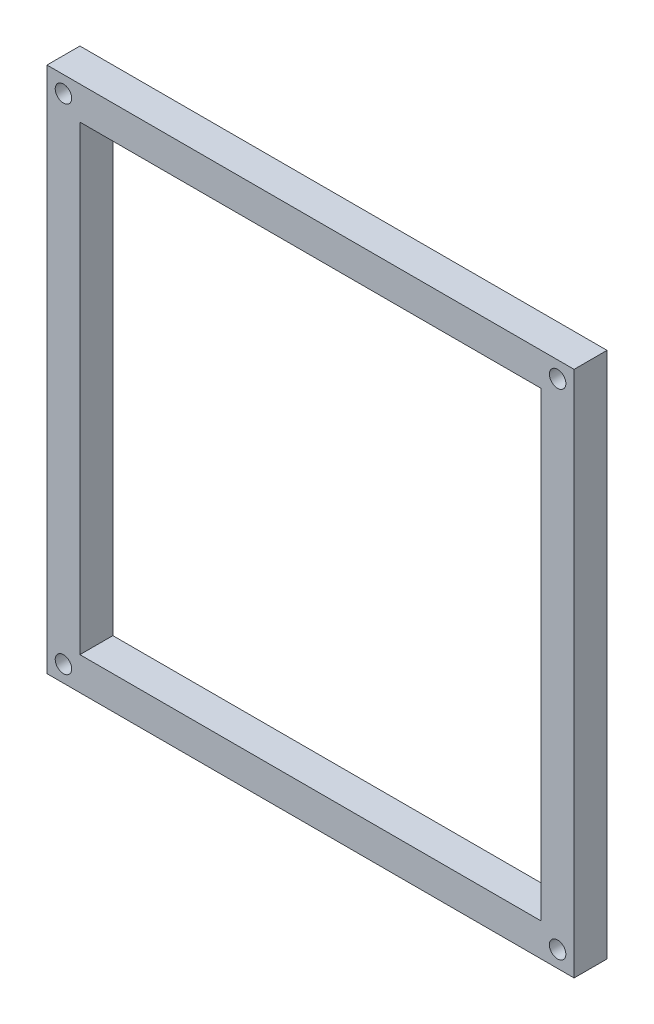
ISO-10303-21;
HEADER;
FILE_DESCRIPTION(('STEP AP214'),'2;1');
FILE_NAME('part.step','',(''),(''),'','','');
FILE_SCHEMA(('AUTOMOTIVE_DESIGN { 1 0 10303 214 1 1 1 1 }'));
ENDSEC;
DATA;
#1=APPLICATION_CONTEXT('core data for automotive mechanical design processes');
#2=APPLICATION_PROTOCOL_DEFINITION('international standard','automotive_design',2000,#1);
#3=PRODUCT_CONTEXT('',#1,'mechanical');
#4=PRODUCT('Part','Part','',(#3));
#5=PRODUCT_RELATED_PRODUCT_CATEGORY('part','',(#4));
#6=PRODUCT_DEFINITION_FORMATION('','',#4);
#7=PRODUCT_DEFINITION_CONTEXT('part definition',#1,'design');
#8=PRODUCT_DEFINITION('design','',#6,#7);
#9=PRODUCT_DEFINITION_SHAPE('','',#8);
#10=(LENGTH_UNIT() NAMED_UNIT(*) SI_UNIT(.MILLI.,.METRE.));
#11=(NAMED_UNIT(*) PLANE_ANGLE_UNIT() SI_UNIT($,.RADIAN.));
#12=(NAMED_UNIT(*) SI_UNIT($,.STERADIAN.) SOLID_ANGLE_UNIT());
#13=UNCERTAINTY_MEASURE_WITH_UNIT(LENGTH_MEASURE(1.E-05),#10,'distance_accuracy_value','');
#14=(GEOMETRIC_REPRESENTATION_CONTEXT(3) GLOBAL_UNCERTAINTY_ASSIGNED_CONTEXT((#13)) GLOBAL_UNIT_ASSIGNED_CONTEXT((#10,
#11,#12)) REPRESENTATION_CONTEXT('',''));
#15=CARTESIAN_POINT('',(0.,0.,0.));
#16=DIRECTION('',(0.,0.,1.));
#17=DIRECTION('',(1.,0.,0.));
#18=AXIS2_PLACEMENT_3D('',#15,#16,#17);
#19=CARTESIAN_POINT('',(0.,0.,10.));
#20=DIRECTION('',(0.,0.,1.));
#21=DIRECTION('',(1.,0.,0.));
#22=AXIS2_PLACEMENT_3D('',#19,#20,#21);
#23=PLANE('',#22);
#24=CARTESIAN_POINT('',(5.,-155.,10.));
#25=DIRECTION('',(0.,0.,1.));
#26=DIRECTION('',(1.,0.,0.));
#27=AXIS2_PLACEMENT_3D('',#24,#25,#26);
#28=CIRCLE('',#27,2.5);
#29=CARTESIAN_POINT('',(7.5,-155.,10.));
#30=VERTEX_POINT('',#29);
#31=EDGE_CURVE('E182',#30,#30,#28,.T.);
#32=ORIENTED_EDGE('',*,*,#31,.F.);
#33=EDGE_LOOP('',(#32));
#34=FACE_BOUND('',#33,.T.);
#35=CARTESIAN_POINT('',(5.00000000000001,-4.99999999999999,10.));
#36=DIRECTION('',(0.,0.,1.));
#37=DIRECTION('',(1.,0.,0.));
#38=AXIS2_PLACEMENT_3D('',#35,#36,#37);
#39=CIRCLE('',#38,2.49999999999996);
#40=CARTESIAN_POINT('',(7.49999999999996,-4.99999999999999,10.));
#41=VERTEX_POINT('',#40);
#42=EDGE_CURVE('E188',#41,#41,#39,.T.);
#43=ORIENTED_EDGE('',*,*,#42,.F.);
#44=EDGE_LOOP('',(#43));
#45=FACE_BOUND('',#44,.T.);
#46=CARTESIAN_POINT('',(155.,-4.99999999999997,10.));
#47=DIRECTION('',(0.,0.,1.));
#48=DIRECTION('',(1.,0.,0.));
#49=AXIS2_PLACEMENT_3D('',#46,#47,#48);
#50=CIRCLE('',#49,2.50000000000007);
#51=CARTESIAN_POINT('',(157.5,-4.99999999999997,10.));
#52=VERTEX_POINT('',#51);
#53=EDGE_CURVE('E176',#52,#52,#50,.T.);
#54=ORIENTED_EDGE('',*,*,#53,.F.);
#55=EDGE_LOOP('',(#54));
#56=FACE_BOUND('',#55,.T.);
#57=CARTESIAN_POINT('',(155.,-155.,10.));
#58=DIRECTION('',(0.,0.,1.));
#59=DIRECTION('',(1.,0.,0.));
#60=AXIS2_PLACEMENT_3D('',#57,#58,#59);
#61=CIRCLE('',#60,2.5);
#62=CARTESIAN_POINT('',(157.5,-155.,10.));
#63=VERTEX_POINT('',#62);
#64=EDGE_CURVE('E173',#63,#63,#61,.T.);
#65=ORIENTED_EDGE('',*,*,#64,.F.);
#66=EDGE_LOOP('',(#65));
#67=FACE_BOUND('',#66,.T.);
#68=DIRECTION('',(-1.,0.,0.));
#69=VECTOR('',#68,1.);
#70=CARTESIAN_POINT('',(0.,0.,10.));
#71=LINE('',#70,#69);
#72=CARTESIAN_POINT('',(160.,0.,10.));
#73=VERTEX_POINT('',#72);
#74=CARTESIAN_POINT('',(0.,0.,10.));
#75=VERTEX_POINT('',#74);
#76=EDGE_CURVE('E105',#73,#75,#71,.T.);
#77=ORIENTED_EDGE('',*,*,#76,.T.);
#78=DIRECTION('',(0.,-1.,0.));
#79=VECTOR('',#78,1.);
#80=CARTESIAN_POINT('',(0.,0.,10.));
#81=LINE('',#80,#79);
#82=CARTESIAN_POINT('',(0.,-160.,10.));
#83=VERTEX_POINT('',#82);
#84=EDGE_CURVE('E107',#75,#83,#81,.T.);
#85=ORIENTED_EDGE('',*,*,#84,.T.);
#86=DIRECTION('',(1.,0.,0.));
#87=VECTOR('',#86,1.);
#88=CARTESIAN_POINT('',(0.,-160.,10.));
#89=LINE('',#88,#87);
#90=CARTESIAN_POINT('',(160.,-160.,10.));
#91=VERTEX_POINT('',#90);
#92=EDGE_CURVE('E114',#83,#91,#89,.T.);
#93=ORIENTED_EDGE('',*,*,#92,.T.);
#94=DIRECTION('',(0.,1.,0.));
#95=VECTOR('',#94,1.);
#96=CARTESIAN_POINT('',(160.,0.,10.));
#97=LINE('',#96,#95);
#98=EDGE_CURVE('E110',#91,#73,#97,.T.);
#99=ORIENTED_EDGE('',*,*,#98,.T.);
#100=EDGE_LOOP('',(#77,#85,#93,#99));
#101=FACE_BOUND('',#100,.T.);
#102=DIRECTION('',(-1.,0.,0.));
#103=VECTOR('',#102,1.);
#104=CARTESIAN_POINT('',(10.,-10.,10.));
#105=LINE('',#104,#103);
#106=CARTESIAN_POINT('',(150.,-10.,10.));
#107=VERTEX_POINT('',#106);
#108=CARTESIAN_POINT('',(10.,-10.,10.));
#109=VERTEX_POINT('',#108);
#110=EDGE_CURVE('E156',#107,#109,#105,.T.);
#111=ORIENTED_EDGE('',*,*,#110,.F.);
#112=DIRECTION('',(0.,1.,0.));
#113=VECTOR('',#112,1.);
#114=CARTESIAN_POINT('',(150.,-10.,10.));
#115=LINE('',#114,#113);
#116=CARTESIAN_POINT('',(150.,-150.,10.));
#117=VERTEX_POINT('',#116);
#118=EDGE_CURVE('E152',#117,#107,#115,.T.);
#119=ORIENTED_EDGE('',*,*,#118,.F.);
#120=DIRECTION('',(1.,0.,0.));
#121=VECTOR('',#120,1.);
#122=CARTESIAN_POINT('',(10.,-150.,10.));
#123=LINE('',#122,#121);
#124=CARTESIAN_POINT('',(10.,-150.,10.));
#125=VERTEX_POINT('',#124);
#126=EDGE_CURVE('E166',#125,#117,#123,.T.);
#127=ORIENTED_EDGE('',*,*,#126,.F.);
#128=DIRECTION('',(0.,-1.,0.));
#129=VECTOR('',#128,1.);
#130=CARTESIAN_POINT('',(10.,-10.,10.));
#131=LINE('',#130,#129);
#132=EDGE_CURVE('E169',#109,#125,#131,.T.);
#133=ORIENTED_EDGE('',*,*,#132,.F.);
#134=EDGE_LOOP('',(#111,#119,#127,#133));
#135=FACE_BOUND('',#134,.T.);
#136=ADVANCED_FACE('F37',(#34,#45,#56,#67,#101,#135),#23,.T.);
#137=CARTESIAN_POINT('',(0.,0.,0.));
#138=DIRECTION('',(0.,0.,1.));
#139=DIRECTION('',(1.,0.,0.));
#140=AXIS2_PLACEMENT_3D('',#137,#138,#139);
#141=PLANE('',#140);
#142=DIRECTION('',(0.,-1.,0.));
#143=VECTOR('',#142,1.);
#144=CARTESIAN_POINT('',(10.,-10.,0.));
#145=LINE('',#144,#143);
#146=CARTESIAN_POINT('',(10.,-10.,0.));
#147=VERTEX_POINT('',#146);
#148=CARTESIAN_POINT('',(10.,-150.,0.));
#149=VERTEX_POINT('',#148);
#150=EDGE_CURVE('E160',#147,#149,#145,.T.);
#151=ORIENTED_EDGE('',*,*,#150,.T.);
#152=DIRECTION('',(1.,0.,0.));
#153=VECTOR('',#152,1.);
#154=CARTESIAN_POINT('',(10.,-150.,0.));
#155=LINE('',#154,#153);
#156=CARTESIAN_POINT('',(150.,-150.,0.));
#157=VERTEX_POINT('',#156);
#158=EDGE_CURVE('E157',#149,#157,#155,.T.);
#159=ORIENTED_EDGE('',*,*,#158,.T.);
#160=DIRECTION('',(0.,1.,0.));
#161=VECTOR('',#160,1.);
#162=CARTESIAN_POINT('',(150.,-10.,0.));
#163=LINE('',#162,#161);
#164=CARTESIAN_POINT('',(150.,-10.,0.));
#165=VERTEX_POINT('',#164);
#166=EDGE_CURVE('E153',#157,#165,#163,.T.);
#167=ORIENTED_EDGE('',*,*,#166,.T.);
#168=DIRECTION('',(-1.,0.,0.));
#169=VECTOR('',#168,1.);
#170=CARTESIAN_POINT('',(10.,-10.,0.));
#171=LINE('',#170,#169);
#172=EDGE_CURVE('E52',#165,#147,#171,.T.);
#173=ORIENTED_EDGE('',*,*,#172,.T.);
#174=EDGE_LOOP('',(#151,#159,#167,#173));
#175=FACE_BOUND('',#174,.T.);
#176=DIRECTION('',(0.,1.,0.));
#177=VECTOR('',#176,1.);
#178=CARTESIAN_POINT('',(160.,0.,0.));
#179=LINE('',#178,#177);
#180=CARTESIAN_POINT('',(160.,-160.,0.));
#181=VERTEX_POINT('',#180);
#182=CARTESIAN_POINT('',(160.,0.,0.));
#183=VERTEX_POINT('',#182);
#184=EDGE_CURVE('E131',#181,#183,#179,.T.);
#185=ORIENTED_EDGE('',*,*,#184,.F.);
#186=DIRECTION('',(1.,0.,0.));
#187=VECTOR('',#186,1.);
#188=CARTESIAN_POINT('',(0.,-160.,0.));
#189=LINE('',#188,#187);
#190=CARTESIAN_POINT('',(0.,-160.,0.));
#191=VERTEX_POINT('',#190);
#192=EDGE_CURVE('E134',#191,#181,#189,.T.);
#193=ORIENTED_EDGE('',*,*,#192,.F.);
#194=DIRECTION('',(0.,-1.,0.));
#195=VECTOR('',#194,1.);
#196=CARTESIAN_POINT('',(0.,0.,0.));
#197=LINE('',#196,#195);
#198=CARTESIAN_POINT('',(0.,0.,0.));
#199=VERTEX_POINT('',#198);
#200=EDGE_CURVE('E137',#199,#191,#197,.T.);
#201=ORIENTED_EDGE('',*,*,#200,.F.);
#202=DIRECTION('',(-1.,0.,0.));
#203=VECTOR('',#202,1.);
#204=CARTESIAN_POINT('',(0.,0.,0.));
#205=LINE('',#204,#203);
#206=EDGE_CURVE('E115',#183,#199,#205,.T.);
#207=ORIENTED_EDGE('',*,*,#206,.F.);
#208=EDGE_LOOP('',(#185,#193,#201,#207));
#209=FACE_BOUND('',#208,.T.);
#210=ADVANCED_FACE('F139',(#175,#209),#141,.F.);
#211=CARTESIAN_POINT('',(0.,0.,10.));
#212=DIRECTION('',(1.,0.,0.));
#213=DIRECTION('',(0.,1.,0.));
#214=AXIS2_PLACEMENT_3D('',#211,#212,#213);
#215=PLANE('',#214);
#216=DIRECTION('',(0.,0.,-1.));
#217=VECTOR('',#216,1.);
#218=CARTESIAN_POINT('',(0.,-160.,10.));
#219=LINE('',#218,#217);
#220=EDGE_CURVE('E11',#83,#191,#219,.T.);
#221=ORIENTED_EDGE('',*,*,#220,.F.);
#222=ORIENTED_EDGE('',*,*,#84,.F.);
#223=DIRECTION('',(0.,0.,-1.));
#224=VECTOR('',#223,1.);
#225=CARTESIAN_POINT('',(0.,0.,10.));
#226=LINE('',#225,#224);
#227=EDGE_CURVE('E60',#75,#199,#226,.T.);
#228=ORIENTED_EDGE('',*,*,#227,.T.);
#229=ORIENTED_EDGE('',*,*,#200,.T.);
#230=EDGE_LOOP('',(#221,#222,#228,#229));
#231=FACE_BOUND('',#230,.T.);
#232=ADVANCED_FACE('F39',(#231),#215,.F.);
#233=CARTESIAN_POINT('',(0.,-160.,10.));
#234=DIRECTION('',(0.,1.,0.));
#235=DIRECTION('',(0.,0.,1.));
#236=AXIS2_PLACEMENT_3D('',#233,#234,#235);
#237=PLANE('',#236);
#238=DIRECTION('',(0.,0.,-1.));
#239=VECTOR('',#238,1.);
#240=CARTESIAN_POINT('',(160.,-160.,10.));
#241=LINE('',#240,#239);
#242=EDGE_CURVE('E45',#91,#181,#241,.T.);
#243=ORIENTED_EDGE('',*,*,#242,.F.);
#244=ORIENTED_EDGE('',*,*,#92,.F.);
#245=ORIENTED_EDGE('',*,*,#220,.T.);
#246=ORIENTED_EDGE('',*,*,#192,.T.);
#247=EDGE_LOOP('',(#243,#244,#245,#246));
#248=FACE_BOUND('',#247,.T.);
#249=ADVANCED_FACE('F135',(#248),#237,.F.);
#250=CARTESIAN_POINT('',(160.,0.,10.));
#251=DIRECTION('',(-1.,0.,0.));
#252=DIRECTION('',(0.,-1.,0.));
#253=AXIS2_PLACEMENT_3D('',#250,#251,#252);
#254=PLANE('',#253);
#255=DIRECTION('',(0.,0.,-1.));
#256=VECTOR('',#255,1.);
#257=CARTESIAN_POINT('',(160.,0.,10.));
#258=LINE('',#257,#256);
#259=EDGE_CURVE('E120',#73,#183,#258,.T.);
#260=ORIENTED_EDGE('',*,*,#259,.F.);
#261=ORIENTED_EDGE('',*,*,#98,.F.);
#262=ORIENTED_EDGE('',*,*,#242,.T.);
#263=ORIENTED_EDGE('',*,*,#184,.T.);
#264=EDGE_LOOP('',(#260,#261,#262,#263));
#265=FACE_BOUND('',#264,.T.);
#266=ADVANCED_FACE('F129',(#265),#254,.F.);
#267=CARTESIAN_POINT('',(0.,0.,10.));
#268=DIRECTION('',(0.,-1.,0.));
#269=DIRECTION('',(0.,0.,-1.));
#270=AXIS2_PLACEMENT_3D('',#267,#268,#269);
#271=PLANE('',#270);
#272=ORIENTED_EDGE('',*,*,#227,.F.);
#273=ORIENTED_EDGE('',*,*,#76,.F.);
#274=ORIENTED_EDGE('',*,*,#259,.T.);
#275=ORIENTED_EDGE('',*,*,#206,.T.);
#276=EDGE_LOOP('',(#272,#273,#274,#275));
#277=FACE_BOUND('',#276,.T.);
#278=ADVANCED_FACE('F117',(#277),#271,.F.);
#279=CARTESIAN_POINT('',(10.,-10.,10.));
#280=DIRECTION('',(0.,-1.,0.));
#281=DIRECTION('',(0.,0.,-1.));
#282=AXIS2_PLACEMENT_3D('',#279,#280,#281);
#283=PLANE('',#282);
#284=ORIENTED_EDGE('',*,*,#172,.F.);
#285=DIRECTION('',(0.,0.,-1.));
#286=VECTOR('',#285,1.);
#287=CARTESIAN_POINT('',(150.,-10.,10.));
#288=LINE('',#287,#286);
#289=EDGE_CURVE('E150',#107,#165,#288,.T.);
#290=ORIENTED_EDGE('',*,*,#289,.F.);
#291=ORIENTED_EDGE('',*,*,#110,.T.);
#292=DIRECTION('',(0.,0.,-1.));
#293=VECTOR('',#292,1.);
#294=CARTESIAN_POINT('',(10.,-10.,10.));
#295=LINE('',#294,#293);
#296=EDGE_CURVE('E141',#109,#147,#295,.T.);
#297=ORIENTED_EDGE('',*,*,#296,.T.);
#298=EDGE_LOOP('',(#284,#290,#291,#297));
#299=FACE_BOUND('',#298,.T.);
#300=ADVANCED_FACE('F229',(#299),#283,.T.);
#301=CARTESIAN_POINT('',(10.,-10.,10.));
#302=DIRECTION('',(1.,0.,0.));
#303=DIRECTION('',(0.,1.,0.));
#304=AXIS2_PLACEMENT_3D('',#301,#302,#303);
#305=PLANE('',#304);
#306=ORIENTED_EDGE('',*,*,#150,.F.);
#307=ORIENTED_EDGE('',*,*,#296,.F.);
#308=ORIENTED_EDGE('',*,*,#132,.T.);
#309=DIRECTION('',(0.,0.,-1.));
#310=VECTOR('',#309,1.);
#311=CARTESIAN_POINT('',(10.,-150.,10.));
#312=LINE('',#311,#310);
#313=EDGE_CURVE('E146',#125,#149,#312,.T.);
#314=ORIENTED_EDGE('',*,*,#313,.T.);
#315=EDGE_LOOP('',(#306,#307,#308,#314));
#316=FACE_BOUND('',#315,.T.);
#317=ADVANCED_FACE('F225',(#316),#305,.T.);
#318=CARTESIAN_POINT('',(10.,-150.,10.));
#319=DIRECTION('',(0.,1.,0.));
#320=DIRECTION('',(0.,0.,1.));
#321=AXIS2_PLACEMENT_3D('',#318,#319,#320);
#322=PLANE('',#321);
#323=ORIENTED_EDGE('',*,*,#158,.F.);
#324=ORIENTED_EDGE('',*,*,#313,.F.);
#325=ORIENTED_EDGE('',*,*,#126,.T.);
#326=DIRECTION('',(0.,0.,-1.));
#327=VECTOR('',#326,1.);
#328=CARTESIAN_POINT('',(150.,-150.,10.));
#329=LINE('',#328,#327);
#330=EDGE_CURVE('E148',#117,#157,#329,.T.);
#331=ORIENTED_EDGE('',*,*,#330,.T.);
#332=EDGE_LOOP('',(#323,#324,#325,#331));
#333=FACE_BOUND('',#332,.T.);
#334=ADVANCED_FACE('F217',(#333),#322,.T.);
#335=CARTESIAN_POINT('',(150.,-10.,10.));
#336=DIRECTION('',(-1.,0.,0.));
#337=DIRECTION('',(0.,-1.,0.));
#338=AXIS2_PLACEMENT_3D('',#335,#336,#337);
#339=PLANE('',#338);
#340=ORIENTED_EDGE('',*,*,#166,.F.);
#341=ORIENTED_EDGE('',*,*,#330,.F.);
#342=ORIENTED_EDGE('',*,*,#118,.T.);
#343=ORIENTED_EDGE('',*,*,#289,.T.);
#344=EDGE_LOOP('',(#340,#341,#342,#343));
#345=FACE_BOUND('',#344,.T.);
#346=ADVANCED_FACE('F208',(#345),#339,.T.);
#347=CARTESIAN_POINT('',(155.,-155.,6.));
#348=DIRECTION('',(0.,0.,1.));
#349=DIRECTION('',(1.,0.,0.));
#350=AXIS2_PLACEMENT_3D('',#347,#348,#349);
#351=CYLINDRICAL_SURFACE('',#350,2.5);
#352=CARTESIAN_POINT('',(155.,-155.,6.));
#353=DIRECTION('',(0.,0.,1.));
#354=DIRECTION('',(1.,0.,0.));
#355=AXIS2_PLACEMENT_3D('',#352,#353,#354);
#356=CIRCLE('',#355,2.5);
#357=CARTESIAN_POINT('',(157.5,-155.,6.));
#358=VERTEX_POINT('',#357);
#359=EDGE_CURVE('E164',#358,#358,#356,.T.);
#360=ORIENTED_EDGE('',*,*,#359,.F.);
#361=EDGE_LOOP('',(#360));
#362=FACE_BOUND('',#361,.T.);
#363=ORIENTED_EDGE('',*,*,#64,.T.);
#364=EDGE_LOOP('',(#363));
#365=FACE_BOUND('',#364,.T.);
#366=ADVANCED_FACE('F205',(#362,#365),#351,.F.);
#367=CARTESIAN_POINT('',(155.,-155.,6.));
#368=DIRECTION('',(0.,0.,1.));
#369=DIRECTION('',(1.,0.,0.));
#370=AXIS2_PLACEMENT_3D('',#367,#368,#369);
#371=PLANE('',#370);
#372=ORIENTED_EDGE('',*,*,#359,.T.);
#373=EDGE_LOOP('',(#372));
#374=FACE_BOUND('',#373,.T.);
#375=ADVANCED_FACE('F207',(#374),#371,.T.);
#376=CARTESIAN_POINT('',(155.,-4.99999999999997,6.));
#377=DIRECTION('',(0.,0.,1.));
#378=DIRECTION('',(1.,0.,0.));
#379=AXIS2_PLACEMENT_3D('',#376,#377,#378);
#380=CYLINDRICAL_SURFACE('',#379,2.50000000000007);
#381=CARTESIAN_POINT('',(155.,-4.99999999999997,6.));
#382=DIRECTION('',(0.,0.,1.));
#383=DIRECTION('',(1.,0.,0.));
#384=AXIS2_PLACEMENT_3D('',#381,#382,#383);
#385=CIRCLE('',#384,2.50000000000007);
#386=CARTESIAN_POINT('',(157.5,-4.99999999999997,6.));
#387=VERTEX_POINT('',#386);
#388=EDGE_CURVE('E191',#387,#387,#385,.T.);
#389=ORIENTED_EDGE('',*,*,#388,.F.);
#390=EDGE_LOOP('',(#389));
#391=FACE_BOUND('',#390,.T.);
#392=ORIENTED_EDGE('',*,*,#53,.T.);
#393=EDGE_LOOP('',(#392));
#394=FACE_BOUND('',#393,.T.);
#395=ADVANCED_FACE('F197',(#391,#394),#380,.F.);
#396=CARTESIAN_POINT('',(155.,-4.99999999999997,6.));
#397=DIRECTION('',(0.,0.,1.));
#398=DIRECTION('',(1.,0.,0.));
#399=AXIS2_PLACEMENT_3D('',#396,#397,#398);
#400=PLANE('',#399);
#401=ORIENTED_EDGE('',*,*,#388,.T.);
#402=EDGE_LOOP('',(#401));
#403=FACE_BOUND('',#402,.T.);
#404=ADVANCED_FACE('F278',(#403),#400,.T.);
#405=CARTESIAN_POINT('',(5.00000000000001,-4.99999999999999,6.));
#406=DIRECTION('',(0.,0.,1.));
#407=DIRECTION('',(1.,0.,0.));
#408=AXIS2_PLACEMENT_3D('',#405,#406,#407);
#409=CYLINDRICAL_SURFACE('',#408,2.49999999999996);
#410=CARTESIAN_POINT('',(5.00000000000001,-4.99999999999999,6.));
#411=DIRECTION('',(0.,0.,1.));
#412=DIRECTION('',(1.,0.,0.));
#413=AXIS2_PLACEMENT_3D('',#410,#411,#412);
#414=CIRCLE('',#413,2.49999999999996);
#415=CARTESIAN_POINT('',(7.49999999999996,-4.99999999999999,6.));
#416=VERTEX_POINT('',#415);
#417=EDGE_CURVE('E185',#416,#416,#414,.T.);
#418=ORIENTED_EDGE('',*,*,#417,.F.);
#419=EDGE_LOOP('',(#418));
#420=FACE_BOUND('',#419,.T.);
#421=ORIENTED_EDGE('',*,*,#42,.T.);
#422=EDGE_LOOP('',(#421));
#423=FACE_BOUND('',#422,.T.);
#424=ADVANCED_FACE('F288',(#420,#423),#409,.F.);
#425=CARTESIAN_POINT('',(5.00000000000001,-4.99999999999999,6.));
#426=DIRECTION('',(0.,0.,1.));
#427=DIRECTION('',(1.,0.,0.));
#428=AXIS2_PLACEMENT_3D('',#425,#426,#427);
#429=PLANE('',#428);
#430=ORIENTED_EDGE('',*,*,#417,.T.);
#431=EDGE_LOOP('',(#430));
#432=FACE_BOUND('',#431,.T.);
#433=ADVANCED_FACE('F298',(#432),#429,.T.);
#434=CARTESIAN_POINT('',(5.,-155.,6.));
#435=DIRECTION('',(0.,0.,1.));
#436=DIRECTION('',(1.,0.,0.));
#437=AXIS2_PLACEMENT_3D('',#434,#435,#436);
#438=CYLINDRICAL_SURFACE('',#437,2.5);
#439=CARTESIAN_POINT('',(5.,-155.,6.));
#440=DIRECTION('',(0.,0.,1.));
#441=DIRECTION('',(1.,0.,0.));
#442=AXIS2_PLACEMENT_3D('',#439,#440,#441);
#443=CIRCLE('',#442,2.5);
#444=CARTESIAN_POINT('',(7.5,-155.,6.));
#445=VERTEX_POINT('',#444);
#446=EDGE_CURVE('E179',#445,#445,#443,.T.);
#447=ORIENTED_EDGE('',*,*,#446,.F.);
#448=EDGE_LOOP('',(#447));
#449=FACE_BOUND('',#448,.T.);
#450=ORIENTED_EDGE('',*,*,#31,.T.);
#451=EDGE_LOOP('',(#450));
#452=FACE_BOUND('',#451,.T.);
#453=ADVANCED_FACE('F308',(#449,#452),#438,.F.);
#454=CARTESIAN_POINT('',(5.,-155.,6.));
#455=DIRECTION('',(0.,0.,1.));
#456=DIRECTION('',(1.,0.,0.));
#457=AXIS2_PLACEMENT_3D('',#454,#455,#456);
#458=PLANE('',#457);
#459=ORIENTED_EDGE('',*,*,#446,.T.);
#460=EDGE_LOOP('',(#459));
#461=FACE_BOUND('',#460,.T.);
#462=ADVANCED_FACE('F318',(#461),#458,.T.);
#463=CLOSED_SHELL('',(#136,#210,#232,#249,#266,#278,#300,#317,#334,#346,#366,#375,#395,#404,
#424,#433,#453,#462));
#464=MANIFOLD_SOLID_BREP('B2',#463);
#465=ADVANCED_BREP_SHAPE_REPRESENTATION('',(#18,#464),#14);
#466=SHAPE_DEFINITION_REPRESENTATION(#9,#465);
ENDSEC;
END-ISO-10303-21;
